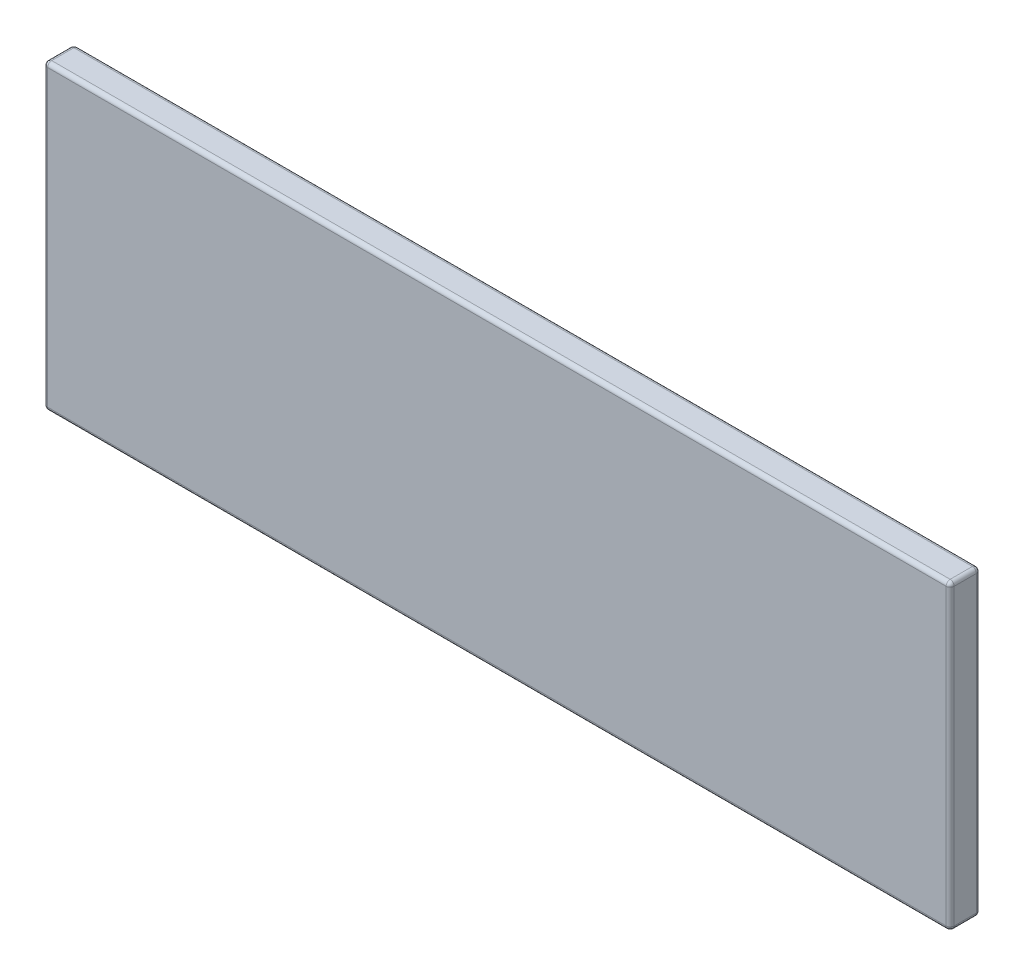
ISO-10303-21;
HEADER;
FILE_DESCRIPTION(('STEP AP214'),'2;1');
FILE_NAME('part.step','',(''),(''),'','','');
FILE_SCHEMA(('AUTOMOTIVE_DESIGN { 1 0 10303 214 1 1 1 1 }'));
ENDSEC;
DATA;
#1=APPLICATION_CONTEXT('core data for automotive mechanical design processes');
#2=APPLICATION_PROTOCOL_DEFINITION('international standard','automotive_design',2000,#1);
#3=PRODUCT_CONTEXT('',#1,'mechanical');
#4=PRODUCT('Part','Part','',(#3));
#5=PRODUCT_RELATED_PRODUCT_CATEGORY('part','',(#4));
#6=PRODUCT_DEFINITION_FORMATION('','',#4);
#7=PRODUCT_DEFINITION_CONTEXT('part definition',#1,'design');
#8=PRODUCT_DEFINITION('design','',#6,#7);
#9=PRODUCT_DEFINITION_SHAPE('','',#8);
#10=(LENGTH_UNIT() NAMED_UNIT(*) SI_UNIT(.MILLI.,.METRE.));
#11=(NAMED_UNIT(*) PLANE_ANGLE_UNIT() SI_UNIT($,.RADIAN.));
#12=(NAMED_UNIT(*) SI_UNIT($,.STERADIAN.) SOLID_ANGLE_UNIT());
#13=UNCERTAINTY_MEASURE_WITH_UNIT(LENGTH_MEASURE(1.E-05),#10,'distance_accuracy_value','');
#14=(GEOMETRIC_REPRESENTATION_CONTEXT(3) GLOBAL_UNCERTAINTY_ASSIGNED_CONTEXT((#13)) GLOBAL_UNIT_ASSIGNED_CONTEXT((#10,
#11,#12)) REPRESENTATION_CONTEXT('',''));
#15=CARTESIAN_POINT('',(0.,0.,0.));
#16=DIRECTION('',(0.,0.,1.));
#17=DIRECTION('',(1.,0.,0.));
#18=AXIS2_PLACEMENT_3D('',#15,#16,#17);
#19=CARTESIAN_POINT('',(0.,0.,30.));
#20=DIRECTION('',(1.,0.,0.));
#21=DIRECTION('',(0.,1.,0.));
#22=AXIS2_PLACEMENT_3D('',#19,#20,#21);
#23=PLANE('',#22);
#24=DIRECTION('',(0.,-1.,0.));
#25=VECTOR('',#24,1.);
#26=CARTESIAN_POINT('',(0.,0.,26.));
#27=LINE('',#26,#25);
#28=CARTESIAN_POINT('',(0.,4.,26.));
#29=VERTEX_POINT('',#28);
#30=CARTESIAN_POINT('',(1.09542005096349E-13,296.,26.));
#31=VERTEX_POINT('',#30);
#32=EDGE_CURVE('E176',#29,#31,#27,.F.);
#33=ORIENTED_EDGE('',*,*,#32,.T.);
#34=DIRECTION('',(0.,0.,-1.));
#35=VECTOR('',#34,1.);
#36=CARTESIAN_POINT('',(1.09542005096349E-13,296.,30.));
#37=LINE('',#36,#35);
#38=CARTESIAN_POINT('',(1.09542005096349E-13,296.,4.));
#39=VERTEX_POINT('',#38);
#40=EDGE_CURVE('E228',#31,#39,#37,.T.);
#41=ORIENTED_EDGE('',*,*,#40,.T.);
#42=DIRECTION('',(0.,-1.,0.));
#43=VECTOR('',#42,1.);
#44=CARTESIAN_POINT('',(0.,0.,4.));
#45=LINE('',#44,#43);
#46=CARTESIAN_POINT('',(0.,4.,4.));
#47=VERTEX_POINT('',#46);
#48=EDGE_CURVE('E198',#39,#47,#45,.T.);
#49=ORIENTED_EDGE('',*,*,#48,.T.);
#50=DIRECTION('',(0.,0.,-1.));
#51=VECTOR('',#50,1.);
#52=CARTESIAN_POINT('',(0.,4.,30.));
#53=LINE('',#52,#51);
#54=EDGE_CURVE('E226',#47,#29,#53,.F.);
#55=ORIENTED_EDGE('',*,*,#54,.T.);
#56=EDGE_LOOP('',(#33,#41,#49,#55));
#57=FACE_BOUND('',#56,.T.);
#58=ADVANCED_FACE('F35',(#57),#23,.F.);
#59=CARTESIAN_POINT('',(0.,0.,30.));
#60=DIRECTION('',(0.,1.,0.));
#61=DIRECTION('',(0.,0.,1.));
#62=AXIS2_PLACEMENT_3D('',#59,#60,#61);
#63=PLANE('',#62);
#64=DIRECTION('',(1.,0.,0.));
#65=VECTOR('',#64,1.);
#66=CARTESIAN_POINT('',(0.,0.,26.));
#67=LINE('',#66,#65);
#68=CARTESIAN_POINT('',(896.,0.,26.));
#69=VERTEX_POINT('',#68);
#70=CARTESIAN_POINT('',(4.,0.,26.));
#71=VERTEX_POINT('',#70);
#72=EDGE_CURVE('E173',#69,#71,#67,.F.);
#73=ORIENTED_EDGE('',*,*,#72,.T.);
#74=DIRECTION('',(0.,0.,-1.));
#75=VECTOR('',#74,1.);
#76=CARTESIAN_POINT('',(4.,0.,30.));
#77=LINE('',#76,#75);
#78=CARTESIAN_POINT('',(4.,0.,4.));
#79=VERTEX_POINT('',#78);
#80=EDGE_CURVE('E236',#71,#79,#77,.T.);
#81=ORIENTED_EDGE('',*,*,#80,.T.);
#82=DIRECTION('',(1.,0.,0.));
#83=VECTOR('',#82,1.);
#84=CARTESIAN_POINT('',(900.,0.,4.));
#85=LINE('',#84,#83);
#86=CARTESIAN_POINT('',(896.,0.,4.));
#87=VERTEX_POINT('',#86);
#88=EDGE_CURVE('E178',#79,#87,#85,.T.);
#89=ORIENTED_EDGE('',*,*,#88,.T.);
#90=DIRECTION('',(0.,0.,-1.));
#91=VECTOR('',#90,1.);
#92=CARTESIAN_POINT('',(896.,0.,30.));
#93=LINE('',#92,#91);
#94=EDGE_CURVE('E234',#87,#69,#93,.F.);
#95=ORIENTED_EDGE('',*,*,#94,.T.);
#96=EDGE_LOOP('',(#73,#81,#89,#95));
#97=FACE_BOUND('',#96,.T.);
#98=ADVANCED_FACE('F285',(#97),#63,.F.);
#99=CARTESIAN_POINT('',(900.,0.,30.));
#100=DIRECTION('',(-1.,0.,0.));
#101=DIRECTION('',(0.,-1.,0.));
#102=AXIS2_PLACEMENT_3D('',#99,#100,#101);
#103=PLANE('',#102);
#104=DIRECTION('',(0.,1.,0.));
#105=VECTOR('',#104,1.);
#106=CARTESIAN_POINT('',(900.,0.,26.));
#107=LINE('',#106,#105);
#108=CARTESIAN_POINT('',(900.,296.,26.));
#109=VERTEX_POINT('',#108);
#110=CARTESIAN_POINT('',(900.,4.,26.));
#111=VERTEX_POINT('',#110);
#112=EDGE_CURVE('E167',#109,#111,#107,.F.);
#113=ORIENTED_EDGE('',*,*,#112,.T.);
#114=DIRECTION('',(0.,0.,-1.));
#115=VECTOR('',#114,1.);
#116=CARTESIAN_POINT('',(900.,4.,30.));
#117=LINE('',#116,#115);
#118=CARTESIAN_POINT('',(900.,4.,4.));
#119=VERTEX_POINT('',#118);
#120=EDGE_CURVE('E11',#111,#119,#117,.T.);
#121=ORIENTED_EDGE('',*,*,#120,.T.);
#122=DIRECTION('',(0.,1.,0.));
#123=VECTOR('',#122,1.);
#124=CARTESIAN_POINT('',(900.,300.,4.));
#125=LINE('',#124,#123);
#126=CARTESIAN_POINT('',(900.,296.,4.));
#127=VERTEX_POINT('',#126);
#128=EDGE_CURVE('E193',#119,#127,#125,.T.);
#129=ORIENTED_EDGE('',*,*,#128,.T.);
#130=DIRECTION('',(0.,0.,-1.));
#131=VECTOR('',#130,1.);
#132=CARTESIAN_POINT('',(900.,296.,30.));
#133=LINE('',#132,#131);
#134=EDGE_CURVE('E44',#127,#109,#133,.F.);
#135=ORIENTED_EDGE('',*,*,#134,.T.);
#136=EDGE_LOOP('',(#113,#121,#129,#135));
#137=FACE_BOUND('',#136,.T.);
#138=ADVANCED_FACE('F297',(#137),#103,.F.);
#139=CARTESIAN_POINT('',(1.11022302462516E-13,300.,30.));
#140=DIRECTION('',(0.,-1.,0.));
#141=DIRECTION('',(0.,0.,-1.));
#142=AXIS2_PLACEMENT_3D('',#139,#140,#141);
#143=PLANE('',#142);
#144=DIRECTION('',(-1.,0.,0.));
#145=VECTOR('',#144,1.);
#146=CARTESIAN_POINT('',(1.11022302462516E-13,300.,4.));
#147=LINE('',#146,#145);
#148=CARTESIAN_POINT('',(896.,300.,4.));
#149=VERTEX_POINT('',#148);
#150=CARTESIAN_POINT('',(4.00000000000011,300.,4.));
#151=VERTEX_POINT('',#150);
#152=EDGE_CURVE('E195',#149,#151,#147,.T.);
#153=ORIENTED_EDGE('',*,*,#152,.T.);
#154=DIRECTION('',(0.,0.,-1.));
#155=VECTOR('',#154,1.);
#156=CARTESIAN_POINT('',(4.00000000000011,300.,30.));
#157=LINE('',#156,#155);
#158=CARTESIAN_POINT('',(4.00000000000011,300.,26.));
#159=VERTEX_POINT('',#158);
#160=EDGE_CURVE('E232',#151,#159,#157,.F.);
#161=ORIENTED_EDGE('',*,*,#160,.T.);
#162=DIRECTION('',(-1.,0.,0.));
#163=VECTOR('',#162,1.);
#164=CARTESIAN_POINT('',(1.11022302462516E-13,300.,26.));
#165=LINE('',#164,#163);
#166=CARTESIAN_POINT('',(896.,300.,26.));
#167=VERTEX_POINT('',#166);
#168=EDGE_CURVE('E148',#159,#167,#165,.F.);
#169=ORIENTED_EDGE('',*,*,#168,.T.);
#170=DIRECTION('',(0.,0.,-1.));
#171=VECTOR('',#170,1.);
#172=CARTESIAN_POINT('',(896.,300.,30.));
#173=LINE('',#172,#171);
#174=EDGE_CURVE('E230',#167,#149,#173,.T.);
#175=ORIENTED_EDGE('',*,*,#174,.T.);
#176=EDGE_LOOP('',(#153,#161,#169,#175));
#177=FACE_BOUND('',#176,.T.);
#178=ADVANCED_FACE('F299',(#177),#143,.F.);
#179=CARTESIAN_POINT('',(0.,0.,30.));
#180=DIRECTION('',(0.,0.,-1.));
#181=DIRECTION('',(-1.,0.,0.));
#182=AXIS2_PLACEMENT_3D('',#179,#180,#181);
#183=PLANE('',#182);
#184=DIRECTION('',(0.,1.,0.));
#185=VECTOR('',#184,1.);
#186=CARTESIAN_POINT('',(896.,-3.3158661002138E-13,30.));
#187=LINE('',#186,#185);
#188=CARTESIAN_POINT('',(896.,4.,30.));
#189=VERTEX_POINT('',#188);
#190=CARTESIAN_POINT('',(896.,296.,30.));
#191=VERTEX_POINT('',#190);
#192=EDGE_CURVE('E165',#189,#191,#187,.T.);
#193=ORIENTED_EDGE('',*,*,#192,.T.);
#194=DIRECTION('',(-1.,0.,0.));
#195=VECTOR('',#194,1.);
#196=CARTESIAN_POINT('',(0.,296.,30.));
#197=LINE('',#196,#195);
#198=CARTESIAN_POINT('',(4.00000000000011,296.,30.));
#199=VERTEX_POINT('',#198);
#200=EDGE_CURVE('E145',#191,#199,#197,.T.);
#201=ORIENTED_EDGE('',*,*,#200,.T.);
#202=DIRECTION('',(0.,-1.,0.));
#203=VECTOR('',#202,1.);
#204=CARTESIAN_POINT('',(4.,0.,30.));
#205=LINE('',#204,#203);
#206=CARTESIAN_POINT('',(4.,4.,30.));
#207=VERTEX_POINT('',#206);
#208=EDGE_CURVE('E153',#199,#207,#205,.T.);
#209=ORIENTED_EDGE('',*,*,#208,.T.);
#210=DIRECTION('',(1.,0.,0.));
#211=VECTOR('',#210,1.);
#212=CARTESIAN_POINT('',(0.,4.,30.));
#213=LINE('',#212,#211);
#214=EDGE_CURVE('E159',#207,#189,#213,.T.);
#215=ORIENTED_EDGE('',*,*,#214,.T.);
#216=EDGE_LOOP('',(#193,#201,#209,#215));
#217=FACE_BOUND('',#216,.T.);
#218=ADVANCED_FACE('F163',(#217),#183,.F.);
#219=CARTESIAN_POINT('',(0.,0.,0.));
#220=DIRECTION('',(0.,0.,-1.));
#221=DIRECTION('',(-1.,0.,0.));
#222=AXIS2_PLACEMENT_3D('',#219,#220,#221);
#223=PLANE('',#222);
#224=DIRECTION('',(0.,1.,0.));
#225=VECTOR('',#224,1.);
#226=CARTESIAN_POINT('',(896.,0.,0.));
#227=LINE('',#226,#225);
#228=CARTESIAN_POINT('',(896.,296.,0.));
#229=VERTEX_POINT('',#228);
#230=CARTESIAN_POINT('',(896.,4.,0.));
#231=VERTEX_POINT('',#230);
#232=EDGE_CURVE('E187',#229,#231,#227,.F.);
#233=ORIENTED_EDGE('',*,*,#232,.T.);
#234=DIRECTION('',(1.,0.,0.));
#235=VECTOR('',#234,1.);
#236=CARTESIAN_POINT('',(0.,4.,0.));
#237=LINE('',#236,#235);
#238=CARTESIAN_POINT('',(4.,4.,0.));
#239=VERTEX_POINT('',#238);
#240=EDGE_CURVE('E190',#231,#239,#237,.F.);
#241=ORIENTED_EDGE('',*,*,#240,.T.);
#242=DIRECTION('',(0.,-1.,0.));
#243=VECTOR('',#242,1.);
#244=CARTESIAN_POINT('',(4.00000000000011,300.,0.));
#245=LINE('',#244,#243);
#246=CARTESIAN_POINT('',(4.00000000000011,296.,0.));
#247=VERTEX_POINT('',#246);
#248=EDGE_CURVE('E181',#239,#247,#245,.F.);
#249=ORIENTED_EDGE('',*,*,#248,.T.);
#250=DIRECTION('',(-1.,0.,0.));
#251=VECTOR('',#250,1.);
#252=CARTESIAN_POINT('',(900.,296.,0.));
#253=LINE('',#252,#251);
#254=EDGE_CURVE('E184',#247,#229,#253,.F.);
#255=ORIENTED_EDGE('',*,*,#254,.T.);
#256=EDGE_LOOP('',(#233,#241,#249,#255));
#257=FACE_BOUND('',#256,.T.);
#258=ADVANCED_FACE('F270',(#257),#223,.T.);
#259=CARTESIAN_POINT('',(0.,4.,26.));
#260=DIRECTION('',(1.,0.,0.));
#261=DIRECTION('',(0.,0.,-1.));
#262=AXIS2_PLACEMENT_3D('',#259,#260,#261);
#263=CYLINDRICAL_SURFACE('',#262,4.);
#264=ORIENTED_EDGE('',*,*,#214,.F.);
#265=CARTESIAN_POINT('',(4.,4.,26.));
#266=DIRECTION('',(1.,0.,0.));
#267=DIRECTION('',(0.,0.,-1.));
#268=AXIS2_PLACEMENT_3D('',#265,#266,#267);
#269=CIRCLE('',#268,4.);
#270=EDGE_CURVE('E212',#207,#71,#269,.T.);
#271=ORIENTED_EDGE('',*,*,#270,.T.);
#272=ORIENTED_EDGE('',*,*,#72,.F.);
#273=CARTESIAN_POINT('',(896.,4.,26.));
#274=DIRECTION('',(1.,0.,0.));
#275=DIRECTION('',(0.,0.,-1.));
#276=AXIS2_PLACEMENT_3D('',#273,#274,#275);
#277=CIRCLE('',#276,4.);
#278=EDGE_CURVE('E210',#69,#189,#277,.F.);
#279=ORIENTED_EDGE('',*,*,#278,.T.);
#280=EDGE_LOOP('',(#264,#271,#272,#279));
#281=FACE_BOUND('',#280,.T.);
#282=ADVANCED_FACE('F290',(#281),#263,.T.);
#283=CARTESIAN_POINT('',(896.,-3.3158661002138E-13,26.));
#284=DIRECTION('',(0.,1.,0.));
#285=DIRECTION('',(-1.,0.,0.));
#286=AXIS2_PLACEMENT_3D('',#283,#284,#285);
#287=CYLINDRICAL_SURFACE('',#286,4.);
#288=ORIENTED_EDGE('',*,*,#192,.F.);
#289=CARTESIAN_POINT('',(896.,4.,26.));
#290=DIRECTION('',(0.,1.,0.));
#291=DIRECTION('',(-1.,0.,0.));
#292=AXIS2_PLACEMENT_3D('',#289,#290,#291);
#293=CIRCLE('',#292,4.);
#294=EDGE_CURVE('E220',#189,#111,#293,.T.);
#295=ORIENTED_EDGE('',*,*,#294,.T.);
#296=ORIENTED_EDGE('',*,*,#112,.F.);
#297=CARTESIAN_POINT('',(896.,296.,26.));
#298=DIRECTION('',(0.,1.,0.));
#299=DIRECTION('',(-1.,0.,0.));
#300=AXIS2_PLACEMENT_3D('',#297,#298,#299);
#301=CIRCLE('',#300,4.);
#302=EDGE_CURVE('E218',#109,#191,#301,.F.);
#303=ORIENTED_EDGE('',*,*,#302,.T.);
#304=EDGE_LOOP('',(#288,#295,#296,#303));
#305=FACE_BOUND('',#304,.T.);
#306=ADVANCED_FACE('F296',(#305),#287,.T.);
#307=CARTESIAN_POINT('',(4.,0.,26.));
#308=DIRECTION('',(0.,-1.,0.));
#309=DIRECTION('',(1.,0.,0.));
#310=AXIS2_PLACEMENT_3D('',#307,#308,#309);
#311=CYLINDRICAL_SURFACE('',#310,4.);
#312=ORIENTED_EDGE('',*,*,#208,.F.);
#313=CARTESIAN_POINT('',(4.00000000000011,296.,26.));
#314=DIRECTION('',(0.,-1.,0.));
#315=DIRECTION('',(1.,0.,0.));
#316=AXIS2_PLACEMENT_3D('',#313,#314,#315);
#317=CIRCLE('',#316,4.);
#318=EDGE_CURVE('E126',#199,#31,#317,.T.);
#319=ORIENTED_EDGE('',*,*,#318,.T.);
#320=ORIENTED_EDGE('',*,*,#32,.F.);
#321=CARTESIAN_POINT('',(4.,4.,26.));
#322=DIRECTION('',(0.,-1.,0.));
#323=DIRECTION('',(1.,0.,0.));
#324=AXIS2_PLACEMENT_3D('',#321,#322,#323);
#325=CIRCLE('',#324,4.);
#326=EDGE_CURVE('E137',#29,#207,#325,.F.);
#327=ORIENTED_EDGE('',*,*,#326,.T.);
#328=EDGE_LOOP('',(#312,#319,#320,#327));
#329=FACE_BOUND('',#328,.T.);
#330=ADVANCED_FACE('F154',(#329),#311,.T.);
#331=CARTESIAN_POINT('',(0.,296.,26.));
#332=DIRECTION('',(-1.,0.,0.));
#333=DIRECTION('',(0.,0.,1.));
#334=AXIS2_PLACEMENT_3D('',#331,#332,#333);
#335=CYLINDRICAL_SURFACE('',#334,4.);
#336=ORIENTED_EDGE('',*,*,#168,.F.);
#337=CARTESIAN_POINT('',(4.00000000000011,296.,26.));
#338=DIRECTION('',(-1.,0.,0.));
#339=DIRECTION('',(0.,0.,1.));
#340=AXIS2_PLACEMENT_3D('',#337,#338,#339);
#341=CIRCLE('',#340,4.);
#342=EDGE_CURVE('E129',#159,#199,#341,.F.);
#343=ORIENTED_EDGE('',*,*,#342,.T.);
#344=ORIENTED_EDGE('',*,*,#200,.F.);
#345=CARTESIAN_POINT('',(896.,296.,26.));
#346=DIRECTION('',(-1.,0.,0.));
#347=DIRECTION('',(0.,0.,1.));
#348=AXIS2_PLACEMENT_3D('',#345,#346,#347);
#349=CIRCLE('',#348,4.);
#350=EDGE_CURVE('E149',#191,#167,#349,.T.);
#351=ORIENTED_EDGE('',*,*,#350,.T.);
#352=EDGE_LOOP('',(#336,#343,#344,#351));
#353=FACE_BOUND('',#352,.T.);
#354=ADVANCED_FACE('F142',(#353),#335,.T.);
#355=CARTESIAN_POINT('',(1.11022302462516E-13,296.,4.));
#356=DIRECTION('',(1.,0.,0.));
#357=DIRECTION('',(0.,0.,-1.));
#358=AXIS2_PLACEMENT_3D('',#355,#356,#357);
#359=CYLINDRICAL_SURFACE('',#358,4.);
#360=ORIENTED_EDGE('',*,*,#254,.F.);
#361=CARTESIAN_POINT('',(4.00000000000011,296.,4.));
#362=DIRECTION('',(1.,0.,0.));
#363=DIRECTION('',(0.,0.,-1.));
#364=AXIS2_PLACEMENT_3D('',#361,#362,#363);
#365=CIRCLE('',#364,4.);
#366=EDGE_CURVE('E208',#247,#151,#365,.T.);
#367=ORIENTED_EDGE('',*,*,#366,.T.);
#368=ORIENTED_EDGE('',*,*,#152,.F.);
#369=CARTESIAN_POINT('',(896.,296.,4.));
#370=DIRECTION('',(1.,0.,0.));
#371=DIRECTION('',(0.,0.,-1.));
#372=AXIS2_PLACEMENT_3D('',#369,#370,#371);
#373=CIRCLE('',#372,4.);
#374=EDGE_CURVE('E206',#149,#229,#373,.F.);
#375=ORIENTED_EDGE('',*,*,#374,.T.);
#376=EDGE_LOOP('',(#360,#367,#368,#375));
#377=FACE_BOUND('',#376,.T.);
#378=ADVANCED_FACE('F267',(#377),#359,.T.);
#379=CARTESIAN_POINT('',(4.,0.,4.));
#380=DIRECTION('',(0.,1.,0.));
#381=DIRECTION('',(-1.,0.,0.));
#382=AXIS2_PLACEMENT_3D('',#379,#380,#381);
#383=CYLINDRICAL_SURFACE('',#382,4.);
#384=ORIENTED_EDGE('',*,*,#48,.F.);
#385=CARTESIAN_POINT('',(4.00000000000011,296.,4.));
#386=DIRECTION('',(0.,1.,0.));
#387=DIRECTION('',(-1.,0.,0.));
#388=AXIS2_PLACEMENT_3D('',#385,#386,#387);
#389=CIRCLE('',#388,4.);
#390=EDGE_CURVE('E204',#39,#247,#389,.F.);
#391=ORIENTED_EDGE('',*,*,#390,.T.);
#392=ORIENTED_EDGE('',*,*,#248,.F.);
#393=CARTESIAN_POINT('',(4.,4.,4.));
#394=DIRECTION('',(0.,1.,0.));
#395=DIRECTION('',(-1.,0.,0.));
#396=AXIS2_PLACEMENT_3D('',#393,#394,#395);
#397=CIRCLE('',#396,4.);
#398=EDGE_CURVE('E136',#239,#47,#397,.T.);
#399=ORIENTED_EDGE('',*,*,#398,.T.);
#400=EDGE_LOOP('',(#384,#391,#392,#399));
#401=FACE_BOUND('',#400,.T.);
#402=ADVANCED_FACE('F329',(#401),#383,.T.);
#403=CARTESIAN_POINT('',(896.,0.,4.));
#404=DIRECTION('',(0.,-1.,0.));
#405=DIRECTION('',(1.,0.,0.));
#406=AXIS2_PLACEMENT_3D('',#403,#404,#405);
#407=CYLINDRICAL_SURFACE('',#406,4.);
#408=ORIENTED_EDGE('',*,*,#128,.F.);
#409=CARTESIAN_POINT('',(896.,4.,4.));
#410=DIRECTION('',(0.,-1.,0.));
#411=DIRECTION('',(1.,0.,0.));
#412=AXIS2_PLACEMENT_3D('',#409,#410,#411);
#413=CIRCLE('',#412,4.);
#414=EDGE_CURVE('E224',#119,#231,#413,.F.);
#415=ORIENTED_EDGE('',*,*,#414,.T.);
#416=ORIENTED_EDGE('',*,*,#232,.F.);
#417=CARTESIAN_POINT('',(896.,296.,4.));
#418=DIRECTION('',(0.,-1.,0.));
#419=DIRECTION('',(1.,0.,0.));
#420=AXIS2_PLACEMENT_3D('',#417,#418,#419);
#421=CIRCLE('',#420,4.);
#422=EDGE_CURVE('E52',#229,#127,#421,.T.);
#423=ORIENTED_EDGE('',*,*,#422,.T.);
#424=EDGE_LOOP('',(#408,#415,#416,#423));
#425=FACE_BOUND('',#424,.T.);
#426=ADVANCED_FACE('F273',(#425),#407,.T.);
#427=CARTESIAN_POINT('',(0.,4.,4.));
#428=DIRECTION('',(-1.,0.,0.));
#429=DIRECTION('',(0.,0.,1.));
#430=AXIS2_PLACEMENT_3D('',#427,#428,#429);
#431=CYLINDRICAL_SURFACE('',#430,4.);
#432=ORIENTED_EDGE('',*,*,#88,.F.);
#433=CARTESIAN_POINT('',(4.,4.,4.));
#434=DIRECTION('',(-1.,0.,0.));
#435=DIRECTION('',(0.,0.,1.));
#436=AXIS2_PLACEMENT_3D('',#433,#434,#435);
#437=CIRCLE('',#436,4.);
#438=EDGE_CURVE('E216',#79,#239,#437,.F.);
#439=ORIENTED_EDGE('',*,*,#438,.T.);
#440=ORIENTED_EDGE('',*,*,#240,.F.);
#441=CARTESIAN_POINT('',(896.,4.,4.));
#442=DIRECTION('',(-1.,0.,0.));
#443=DIRECTION('',(0.,0.,1.));
#444=AXIS2_PLACEMENT_3D('',#441,#442,#443);
#445=CIRCLE('',#444,4.);
#446=EDGE_CURVE('E214',#231,#87,#445,.T.);
#447=ORIENTED_EDGE('',*,*,#446,.T.);
#448=EDGE_LOOP('',(#432,#439,#440,#447));
#449=FACE_BOUND('',#448,.T.);
#450=ADVANCED_FACE('F322',(#449),#431,.T.);
#451=CARTESIAN_POINT('',(4.00000000000011,296.,4.));
#452=DIRECTION('',(0.,0.,1.));
#453=DIRECTION('',(1.,0.,0.));
#454=AXIS2_PLACEMENT_3D('',#451,#452,#453);
#455=SPHERICAL_SURFACE('',#454,4.);
#456=ORIENTED_EDGE('',*,*,#366,.F.);
#457=ORIENTED_EDGE('',*,*,#390,.F.);
#458=CARTESIAN_POINT('',(4.00000000000011,296.,4.));
#459=DIRECTION('',(0.,0.,1.));
#460=DIRECTION('',(1.,0.,0.));
#461=AXIS2_PLACEMENT_3D('',#458,#459,#460);
#462=CIRCLE('',#461,4.);
#463=EDGE_CURVE('E160',#151,#39,#462,.T.);
#464=ORIENTED_EDGE('',*,*,#463,.F.);
#465=EDGE_LOOP('',(#456,#457,#464));
#466=FACE_BOUND('',#465,.T.);
#467=ADVANCED_FACE('F325',(#466),#455,.T.);
#468=CARTESIAN_POINT('',(4.00000000000011,296.,30.));
#469=DIRECTION('',(0.,0.,-1.));
#470=DIRECTION('',(-1.,0.,0.));
#471=AXIS2_PLACEMENT_3D('',#468,#469,#470);
#472=CYLINDRICAL_SURFACE('',#471,4.);
#473=ORIENTED_EDGE('',*,*,#463,.T.);
#474=ORIENTED_EDGE('',*,*,#40,.F.);
#475=CARTESIAN_POINT('',(4.00000000000011,296.,26.));
#476=DIRECTION('',(0.,0.,1.));
#477=DIRECTION('',(1.,0.,0.));
#478=AXIS2_PLACEMENT_3D('',#475,#476,#477);
#479=CIRCLE('',#478,4.);
#480=EDGE_CURVE('E131',#159,#31,#479,.T.);
#481=ORIENTED_EDGE('',*,*,#480,.F.);
#482=ORIENTED_EDGE('',*,*,#160,.F.);
#483=EDGE_LOOP('',(#473,#474,#481,#482));
#484=FACE_BOUND('',#483,.T.);
#485=ADVANCED_FACE('F338',(#484),#472,.T.);
#486=CARTESIAN_POINT('',(4.00000000000011,296.,26.));
#487=DIRECTION('',(0.,0.,1.));
#488=DIRECTION('',(1.,0.,0.));
#489=AXIS2_PLACEMENT_3D('',#486,#487,#488);
#490=SPHERICAL_SURFACE('',#489,4.);
#491=ORIENTED_EDGE('',*,*,#480,.T.);
#492=ORIENTED_EDGE('',*,*,#318,.F.);
#493=ORIENTED_EDGE('',*,*,#342,.F.);
#494=EDGE_LOOP('',(#491,#492,#493));
#495=FACE_BOUND('',#494,.T.);
#496=ADVANCED_FACE('F128',(#495),#490,.T.);
#497=CARTESIAN_POINT('',(4.,4.,4.));
#498=DIRECTION('',(0.,0.,1.));
#499=DIRECTION('',(1.,0.,0.));
#500=AXIS2_PLACEMENT_3D('',#497,#498,#499);
#501=SPHERICAL_SURFACE('',#500,4.);
#502=ORIENTED_EDGE('',*,*,#398,.F.);
#503=ORIENTED_EDGE('',*,*,#438,.F.);
#504=CARTESIAN_POINT('',(4.,4.,4.));
#505=DIRECTION('',(0.,0.,1.));
#506=DIRECTION('',(1.,0.,0.));
#507=AXIS2_PLACEMENT_3D('',#504,#505,#506);
#508=CIRCLE('',#507,4.);
#509=EDGE_CURVE('E240',#47,#79,#508,.T.);
#510=ORIENTED_EDGE('',*,*,#509,.F.);
#511=EDGE_LOOP('',(#502,#503,#510));
#512=FACE_BOUND('',#511,.T.);
#513=ADVANCED_FACE('F337',(#512),#501,.T.);
#514=CARTESIAN_POINT('',(4.,4.,30.));
#515=DIRECTION('',(0.,0.,-1.));
#516=DIRECTION('',(-1.,0.,0.));
#517=AXIS2_PLACEMENT_3D('',#514,#515,#516);
#518=CYLINDRICAL_SURFACE('',#517,4.);
#519=ORIENTED_EDGE('',*,*,#509,.T.);
#520=ORIENTED_EDGE('',*,*,#80,.F.);
#521=CARTESIAN_POINT('',(4.,4.,26.));
#522=DIRECTION('',(0.,0.,1.));
#523=DIRECTION('',(1.,0.,0.));
#524=AXIS2_PLACEMENT_3D('',#521,#522,#523);
#525=CIRCLE('',#524,4.);
#526=EDGE_CURVE('E243',#29,#71,#525,.T.);
#527=ORIENTED_EDGE('',*,*,#526,.F.);
#528=ORIENTED_EDGE('',*,*,#54,.F.);
#529=EDGE_LOOP('',(#519,#520,#527,#528));
#530=FACE_BOUND('',#529,.T.);
#531=ADVANCED_FACE('F348',(#530),#518,.T.);
#532=CARTESIAN_POINT('',(4.,4.,26.));
#533=DIRECTION('',(0.,0.,1.));
#534=DIRECTION('',(1.,0.,0.));
#535=AXIS2_PLACEMENT_3D('',#532,#533,#534);
#536=SPHERICAL_SURFACE('',#535,4.);
#537=ORIENTED_EDGE('',*,*,#526,.T.);
#538=ORIENTED_EDGE('',*,*,#270,.F.);
#539=ORIENTED_EDGE('',*,*,#326,.F.);
#540=EDGE_LOOP('',(#537,#538,#539));
#541=FACE_BOUND('',#540,.T.);
#542=ADVANCED_FACE('F345',(#541),#536,.T.);
#543=CARTESIAN_POINT('',(896.,4.,4.));
#544=DIRECTION('',(0.,0.,1.));
#545=DIRECTION('',(1.,0.,0.));
#546=AXIS2_PLACEMENT_3D('',#543,#544,#545);
#547=SPHERICAL_SURFACE('',#546,4.);
#548=ORIENTED_EDGE('',*,*,#446,.F.);
#549=ORIENTED_EDGE('',*,*,#414,.F.);
#550=CARTESIAN_POINT('',(896.,4.,4.));
#551=DIRECTION('',(0.,0.,1.));
#552=DIRECTION('',(1.,0.,0.));
#553=AXIS2_PLACEMENT_3D('',#550,#551,#552);
#554=CIRCLE('',#553,4.);
#555=EDGE_CURVE('E246',#87,#119,#554,.T.);
#556=ORIENTED_EDGE('',*,*,#555,.F.);
#557=EDGE_LOOP('',(#548,#549,#556));
#558=FACE_BOUND('',#557,.T.);
#559=ADVANCED_FACE('F278',(#558),#547,.T.);
#560=CARTESIAN_POINT('',(896.,4.,30.));
#561=DIRECTION('',(0.,0.,-1.));
#562=DIRECTION('',(-1.,0.,0.));
#563=AXIS2_PLACEMENT_3D('',#560,#561,#562);
#564=CYLINDRICAL_SURFACE('',#563,4.);
#565=ORIENTED_EDGE('',*,*,#555,.T.);
#566=ORIENTED_EDGE('',*,*,#120,.F.);
#567=CARTESIAN_POINT('',(896.,4.,26.));
#568=DIRECTION('',(0.,0.,1.));
#569=DIRECTION('',(1.,0.,0.));
#570=AXIS2_PLACEMENT_3D('',#567,#568,#569);
#571=CIRCLE('',#570,4.);
#572=EDGE_CURVE('E249',#69,#111,#571,.T.);
#573=ORIENTED_EDGE('',*,*,#572,.F.);
#574=ORIENTED_EDGE('',*,*,#94,.F.);
#575=EDGE_LOOP('',(#565,#566,#573,#574));
#576=FACE_BOUND('',#575,.T.);
#577=ADVANCED_FACE('F281',(#576),#564,.T.);
#578=CARTESIAN_POINT('',(896.,4.,26.));
#579=DIRECTION('',(0.,0.,1.));
#580=DIRECTION('',(1.,0.,0.));
#581=AXIS2_PLACEMENT_3D('',#578,#579,#580);
#582=SPHERICAL_SURFACE('',#581,4.);
#583=ORIENTED_EDGE('',*,*,#294,.F.);
#584=ORIENTED_EDGE('',*,*,#278,.F.);
#585=ORIENTED_EDGE('',*,*,#572,.T.);
#586=EDGE_LOOP('',(#583,#584,#585));
#587=FACE_BOUND('',#586,.T.);
#588=ADVANCED_FACE('F293',(#587),#582,.T.);
#589=CARTESIAN_POINT('',(896.,296.,4.));
#590=DIRECTION('',(0.,0.,1.));
#591=DIRECTION('',(1.,0.,0.));
#592=AXIS2_PLACEMENT_3D('',#589,#590,#591);
#593=SPHERICAL_SURFACE('',#592,4.);
#594=ORIENTED_EDGE('',*,*,#422,.F.);
#595=ORIENTED_EDGE('',*,*,#374,.F.);
#596=CARTESIAN_POINT('',(896.,296.,4.));
#597=DIRECTION('',(0.,0.,1.));
#598=DIRECTION('',(1.,0.,0.));
#599=AXIS2_PLACEMENT_3D('',#596,#597,#598);
#600=CIRCLE('',#599,4.);
#601=EDGE_CURVE('E39',#127,#149,#600,.T.);
#602=ORIENTED_EDGE('',*,*,#601,.F.);
#603=EDGE_LOOP('',(#594,#595,#602));
#604=FACE_BOUND('',#603,.T.);
#605=ADVANCED_FACE('F37',(#604),#593,.T.);
#606=CARTESIAN_POINT('',(896.,296.,30.));
#607=DIRECTION('',(0.,0.,-1.));
#608=DIRECTION('',(-1.,0.,0.));
#609=AXIS2_PLACEMENT_3D('',#606,#607,#608);
#610=CYLINDRICAL_SURFACE('',#609,4.);
#611=ORIENTED_EDGE('',*,*,#601,.T.);
#612=ORIENTED_EDGE('',*,*,#174,.F.);
#613=CARTESIAN_POINT('',(896.,296.,26.));
#614=DIRECTION('',(0.,0.,1.));
#615=DIRECTION('',(1.,0.,0.));
#616=AXIS2_PLACEMENT_3D('',#613,#614,#615);
#617=CIRCLE('',#616,4.);
#618=EDGE_CURVE('E252',#109,#167,#617,.T.);
#619=ORIENTED_EDGE('',*,*,#618,.F.);
#620=ORIENTED_EDGE('',*,*,#134,.F.);
#621=EDGE_LOOP('',(#611,#612,#619,#620));
#622=FACE_BOUND('',#621,.T.);
#623=ADVANCED_FACE('F261',(#622),#610,.T.);
#624=CARTESIAN_POINT('',(896.,296.,26.));
#625=DIRECTION('',(0.,0.,1.));
#626=DIRECTION('',(1.,0.,0.));
#627=AXIS2_PLACEMENT_3D('',#624,#625,#626);
#628=SPHERICAL_SURFACE('',#627,4.);
#629=ORIENTED_EDGE('',*,*,#350,.F.);
#630=ORIENTED_EDGE('',*,*,#302,.F.);
#631=ORIENTED_EDGE('',*,*,#618,.T.);
#632=EDGE_LOOP('',(#629,#630,#631));
#633=FACE_BOUND('',#632,.T.);
#634=ADVANCED_FACE('F362',(#633),#628,.T.);
#635=CLOSED_SHELL('',(#58,#98,#138,#178,#218,#258,#282,#306,#330,#354,#378,#402,#426,#450,#467,
#485,#496,#513,#531,#542,#559,#577,#588,#605,#623,#634));
#636=MANIFOLD_SOLID_BREP('B2',#635);
#637=ADVANCED_BREP_SHAPE_REPRESENTATION('',(#18,#636),#14);
#638=SHAPE_DEFINITION_REPRESENTATION(#9,#637);
ENDSEC;
END-ISO-10303-21;
